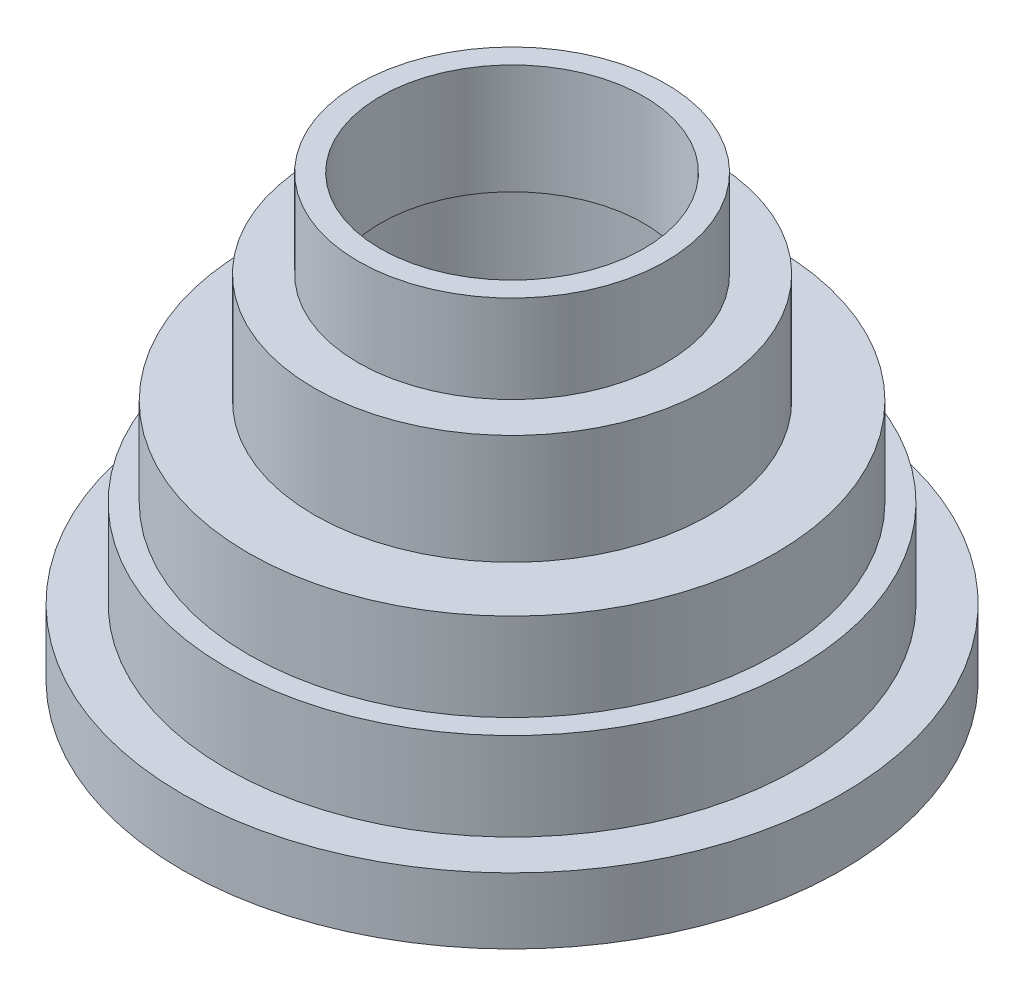
ISO-10303-21;
HEADER;
FILE_DESCRIPTION(('STEP AP214'),'2;1');
FILE_NAME('part.step','',(''),(''),'','','');
FILE_SCHEMA(('AUTOMOTIVE_DESIGN { 1 0 10303 214 1 1 1 1 }'));
ENDSEC;
DATA;
#1=APPLICATION_CONTEXT('core data for automotive mechanical design processes');
#2=APPLICATION_PROTOCOL_DEFINITION('international standard','automotive_design',2000,#1);
#3=PRODUCT_CONTEXT('',#1,'mechanical');
#4=PRODUCT('Part','Part','',(#3));
#5=PRODUCT_RELATED_PRODUCT_CATEGORY('part','',(#4));
#6=PRODUCT_DEFINITION_FORMATION('','',#4);
#7=PRODUCT_DEFINITION_CONTEXT('part definition',#1,'design');
#8=PRODUCT_DEFINITION('design','',#6,#7);
#9=PRODUCT_DEFINITION_SHAPE('','',#8);
#10=(LENGTH_UNIT() NAMED_UNIT(*) SI_UNIT(.MILLI.,.METRE.));
#11=(NAMED_UNIT(*) PLANE_ANGLE_UNIT() SI_UNIT($,.RADIAN.));
#12=(NAMED_UNIT(*) SI_UNIT($,.STERADIAN.) SOLID_ANGLE_UNIT());
#13=UNCERTAINTY_MEASURE_WITH_UNIT(LENGTH_MEASURE(1.E-05),#10,'distance_accuracy_value','');
#14=(GEOMETRIC_REPRESENTATION_CONTEXT(3) GLOBAL_UNCERTAINTY_ASSIGNED_CONTEXT((#13)) GLOBAL_UNIT_ASSIGNED_CONTEXT((#10,
#11,#12)) REPRESENTATION_CONTEXT('',''));
#15=CARTESIAN_POINT('',(0.,0.,0.));
#16=DIRECTION('',(0.,0.,1.));
#17=DIRECTION('',(1.,0.,0.));
#18=AXIS2_PLACEMENT_3D('',#15,#16,#17);
#19=CARTESIAN_POINT('',(0.,50.,0.));
#20=DIRECTION('',(0.,1.,0.));
#21=DIRECTION('',(0.,0.,1.));
#22=AXIS2_PLACEMENT_3D('',#19,#20,#21);
#23=CYLINDRICAL_SURFACE('',#22,30.);
#24=CARTESIAN_POINT('',(0.,47.7659574468085,0.));
#25=DIRECTION('',(0.,1.,0.));
#26=DIRECTION('',(0.,0.,1.));
#27=AXIS2_PLACEMENT_3D('',#24,#25,#26);
#28=CIRCLE('',#27,30.);
#29=CARTESIAN_POINT('',(0.,47.7659574468085,30.));
#30=VERTEX_POINT('',#29);
#31=EDGE_CURVE('E126',#30,#30,#28,.T.);
#32=ORIENTED_EDGE('',*,*,#31,.T.);
#33=EDGE_LOOP('',(#32));
#34=FACE_BOUND('',#33,.T.);
#35=CARTESIAN_POINT('',(0.,22.7659574468085,0.));
#36=DIRECTION('',(0.,1.,0.));
#37=DIRECTION('',(0.,0.,1.));
#38=AXIS2_PLACEMENT_3D('',#35,#36,#37);
#39=CIRCLE('',#38,30.);
#40=CARTESIAN_POINT('',(0.,22.7659574468085,30.));
#41=VERTEX_POINT('',#40);
#42=EDGE_CURVE('E10',#41,#41,#39,.T.);
#43=ORIENTED_EDGE('',*,*,#42,.F.);
#44=EDGE_LOOP('',(#43));
#45=FACE_BOUND('',#44,.T.);
#46=ADVANCED_FACE('F43',(#34,#45),#23,.F.);
#47=CARTESIAN_POINT('',(-45.,22.7659574468085,0.));
#48=DIRECTION('',(0.,-1.,0.));
#49=DIRECTION('',(0.,0.,-1.));
#50=AXIS2_PLACEMENT_3D('',#47,#48,#49);
#51=PLANE('',#50);
#52=ORIENTED_EDGE('',*,*,#42,.T.);
#53=EDGE_LOOP('',(#52));
#54=FACE_BOUND('',#53,.T.);
#55=CARTESIAN_POINT('',(0.,22.7659574468085,0.));
#56=DIRECTION('',(0.,1.,0.));
#57=DIRECTION('',(0.,0.,1.));
#58=AXIS2_PLACEMENT_3D('',#55,#56,#57);
#59=CIRCLE('',#58,40.);
#60=CARTESIAN_POINT('',(0.,22.7659574468085,40.));
#61=VERTEX_POINT('',#60);
#62=EDGE_CURVE('E50',#61,#61,#59,.T.);
#63=ORIENTED_EDGE('',*,*,#62,.F.);
#64=EDGE_LOOP('',(#63));
#65=FACE_BOUND('',#64,.T.);
#66=ADVANCED_FACE('F211',(#54,#65),#51,.T.);
#67=CARTESIAN_POINT('',(0.,50.,0.));
#68=DIRECTION('',(0.,1.,0.));
#69=DIRECTION('',(0.,0.,1.));
#70=AXIS2_PLACEMENT_3D('',#67,#68,#69);
#71=CYLINDRICAL_SURFACE('',#70,40.);
#72=ORIENTED_EDGE('',*,*,#62,.T.);
#73=EDGE_LOOP('',(#72));
#74=FACE_BOUND('',#73,.T.);
#75=CARTESIAN_POINT('',(0.,-2.2340425531915,0.));
#76=DIRECTION('',(0.,1.,0.));
#77=DIRECTION('',(0.,0.,1.));
#78=AXIS2_PLACEMENT_3D('',#75,#76,#77);
#79=CIRCLE('',#78,40.);
#80=CARTESIAN_POINT('',(0.,-2.2340425531915,40.));
#81=VERTEX_POINT('',#80);
#82=EDGE_CURVE('E55',#81,#81,#79,.T.);
#83=ORIENTED_EDGE('',*,*,#82,.F.);
#84=EDGE_LOOP('',(#83));
#85=FACE_BOUND('',#84,.T.);
#86=ADVANCED_FACE('F215',(#74,#85),#71,.F.);
#87=CARTESIAN_POINT('',(-60.,-2.2340425531915,0.));
#88=DIRECTION('',(0.,-1.,0.));
#89=DIRECTION('',(0.,0.,-1.));
#90=AXIS2_PLACEMENT_3D('',#87,#88,#89);
#91=PLANE('',#90);
#92=ORIENTED_EDGE('',*,*,#82,.T.);
#93=EDGE_LOOP('',(#92));
#94=FACE_BOUND('',#93,.T.);
#95=CARTESIAN_POINT('',(0.,-2.2340425531915,0.));
#96=DIRECTION('',(0.,1.,0.));
#97=DIRECTION('',(0.,0.,1.));
#98=AXIS2_PLACEMENT_3D('',#95,#96,#97);
#99=CIRCLE('',#98,55.);
#100=CARTESIAN_POINT('',(0.,-2.2340425531915,55.));
#101=VERTEX_POINT('',#100);
#102=EDGE_CURVE('E60',#101,#101,#99,.T.);
#103=ORIENTED_EDGE('',*,*,#102,.F.);
#104=EDGE_LOOP('',(#103));
#105=FACE_BOUND('',#104,.T.);
#106=ADVANCED_FACE('F219',(#94,#105),#91,.T.);
#107=CARTESIAN_POINT('',(0.,50.,0.));
#108=DIRECTION('',(0.,1.,0.));
#109=DIRECTION('',(0.,0.,1.));
#110=AXIS2_PLACEMENT_3D('',#107,#108,#109);
#111=CYLINDRICAL_SURFACE('',#110,55.);
#112=ORIENTED_EDGE('',*,*,#102,.T.);
#113=EDGE_LOOP('',(#112));
#114=FACE_BOUND('',#113,.T.);
#115=CARTESIAN_POINT('',(0.,-22.2340425531915,0.));
#116=DIRECTION('',(0.,1.,0.));
#117=DIRECTION('',(0.,0.,1.));
#118=AXIS2_PLACEMENT_3D('',#115,#116,#117);
#119=CIRCLE('',#118,55.);
#120=CARTESIAN_POINT('',(0.,-22.2340425531915,55.));
#121=VERTEX_POINT('',#120);
#122=EDGE_CURVE('E66',#121,#121,#119,.T.);
#123=ORIENTED_EDGE('',*,*,#122,.F.);
#124=EDGE_LOOP('',(#123));
#125=FACE_BOUND('',#124,.T.);
#126=ADVANCED_FACE('F225',(#114,#125),#111,.F.);
#127=CARTESIAN_POINT('',(-65.,-22.2340425531915,0.));
#128=DIRECTION('',(0.,-1.,0.));
#129=DIRECTION('',(0.,0.,-1.));
#130=AXIS2_PLACEMENT_3D('',#127,#128,#129);
#131=PLANE('',#130);
#132=ORIENTED_EDGE('',*,*,#122,.T.);
#133=EDGE_LOOP('',(#132));
#134=FACE_BOUND('',#133,.T.);
#135=CARTESIAN_POINT('',(0.,-22.2340425531915,0.));
#136=DIRECTION('',(0.,1.,0.));
#137=DIRECTION('',(0.,0.,1.));
#138=AXIS2_PLACEMENT_3D('',#135,#136,#137);
#139=CIRCLE('',#138,60.);
#140=CARTESIAN_POINT('',(0.,-22.2340425531915,60.));
#141=VERTEX_POINT('',#140);
#142=EDGE_CURVE('E70',#141,#141,#139,.T.);
#143=ORIENTED_EDGE('',*,*,#142,.F.);
#144=EDGE_LOOP('',(#143));
#145=FACE_BOUND('',#144,.T.);
#146=ADVANCED_FACE('F229',(#134,#145),#131,.T.);
#147=CARTESIAN_POINT('',(0.,50.,0.));
#148=DIRECTION('',(0.,1.,0.));
#149=DIRECTION('',(0.,0.,1.));
#150=AXIS2_PLACEMENT_3D('',#147,#148,#149);
#151=CYLINDRICAL_SURFACE('',#150,60.);
#152=ORIENTED_EDGE('',*,*,#142,.T.);
#153=EDGE_LOOP('',(#152));
#154=FACE_BOUND('',#153,.T.);
#155=CARTESIAN_POINT('',(0.,-42.2340425531915,0.));
#156=DIRECTION('',(0.,1.,0.));
#157=DIRECTION('',(0.,0.,1.));
#158=AXIS2_PLACEMENT_3D('',#155,#156,#157);
#159=CIRCLE('',#158,60.);
#160=CARTESIAN_POINT('',(0.,-42.2340425531915,60.));
#161=VERTEX_POINT('',#160);
#162=EDGE_CURVE('E74',#161,#161,#159,.T.);
#163=ORIENTED_EDGE('',*,*,#162,.F.);
#164=EDGE_LOOP('',(#163));
#165=FACE_BOUND('',#164,.T.);
#166=ADVANCED_FACE('F207',(#154,#165),#151,.F.);
#167=CARTESIAN_POINT('',(-75.,-42.2340425531915,0.));
#168=DIRECTION('',(0.,-1.,0.));
#169=DIRECTION('',(0.,0.,-1.));
#170=AXIS2_PLACEMENT_3D('',#167,#168,#169);
#171=PLANE('',#170);
#172=ORIENTED_EDGE('',*,*,#162,.T.);
#173=EDGE_LOOP('',(#172));
#174=FACE_BOUND('',#173,.T.);
#175=CARTESIAN_POINT('',(0.,-42.2340425531915,0.));
#176=DIRECTION('',(0.,1.,0.));
#177=DIRECTION('',(0.,0.,1.));
#178=AXIS2_PLACEMENT_3D('',#175,#176,#177);
#179=CIRCLE('',#178,70.);
#180=CARTESIAN_POINT('',(0.,-42.2340425531915,70.));
#181=VERTEX_POINT('',#180);
#182=EDGE_CURVE('E78',#181,#181,#179,.T.);
#183=ORIENTED_EDGE('',*,*,#182,.F.);
#184=EDGE_LOOP('',(#183));
#185=FACE_BOUND('',#184,.T.);
#186=ADVANCED_FACE('F201',(#174,#185),#171,.T.);
#187=CARTESIAN_POINT('',(0.,50.,0.));
#188=DIRECTION('',(0.,1.,0.));
#189=DIRECTION('',(0.,0.,1.));
#190=AXIS2_PLACEMENT_3D('',#187,#188,#189);
#191=CYLINDRICAL_SURFACE('',#190,70.);
#192=ORIENTED_EDGE('',*,*,#182,.T.);
#193=EDGE_LOOP('',(#192));
#194=FACE_BOUND('',#193,.T.);
#195=CARTESIAN_POINT('',(0.,-52.2340425531915,0.));
#196=DIRECTION('',(0.,1.,0.));
#197=DIRECTION('',(0.,0.,1.));
#198=AXIS2_PLACEMENT_3D('',#195,#196,#197);
#199=CIRCLE('',#198,70.);
#200=CARTESIAN_POINT('',(0.,-52.2340425531915,70.));
#201=VERTEX_POINT('',#200);
#202=EDGE_CURVE('E82',#201,#201,#199,.T.);
#203=ORIENTED_EDGE('',*,*,#202,.F.);
#204=EDGE_LOOP('',(#203));
#205=FACE_BOUND('',#204,.T.);
#206=ADVANCED_FACE('F196',(#194,#205),#191,.F.);
#207=CARTESIAN_POINT('',(-70.,-52.2340425531915,0.));
#208=DIRECTION('',(0.,1.,0.));
#209=DIRECTION('',(0.,0.,1.));
#210=AXIS2_PLACEMENT_3D('',#207,#208,#209);
#211=PLANE('',#210);
#212=CARTESIAN_POINT('',(0.,-52.2340425531915,0.));
#213=DIRECTION('',(0.,1.,0.));
#214=DIRECTION('',(0.,0.,1.));
#215=AXIS2_PLACEMENT_3D('',#212,#213,#214);
#216=CIRCLE('',#215,75.);
#217=CARTESIAN_POINT('',(0.,-52.2340425531915,75.));
#218=VERTEX_POINT('',#217);
#219=EDGE_CURVE('E86',#218,#218,#216,.T.);
#220=ORIENTED_EDGE('',*,*,#219,.F.);
#221=EDGE_LOOP('',(#220));
#222=FACE_BOUND('',#221,.T.);
#223=ORIENTED_EDGE('',*,*,#202,.T.);
#224=EDGE_LOOP('',(#223));
#225=FACE_BOUND('',#224,.T.);
#226=ADVANCED_FACE('F190',(#222,#225),#211,.F.);
#227=CARTESIAN_POINT('',(0.,50.,0.));
#228=DIRECTION('',(0.,1.,0.));
#229=DIRECTION('',(0.,0.,1.));
#230=AXIS2_PLACEMENT_3D('',#227,#228,#229);
#231=CYLINDRICAL_SURFACE('',#230,75.);
#232=CARTESIAN_POINT('',(0.,-37.2340425531915,0.));
#233=DIRECTION('',(0.,1.,0.));
#234=DIRECTION('',(0.,0.,1.));
#235=AXIS2_PLACEMENT_3D('',#232,#233,#234);
#236=CIRCLE('',#235,75.);
#237=CARTESIAN_POINT('',(0.,-37.2340425531915,75.));
#238=VERTEX_POINT('',#237);
#239=EDGE_CURVE('E90',#238,#238,#236,.T.);
#240=ORIENTED_EDGE('',*,*,#239,.F.);
#241=EDGE_LOOP('',(#240));
#242=FACE_BOUND('',#241,.T.);
#243=ORIENTED_EDGE('',*,*,#219,.T.);
#244=EDGE_LOOP('',(#243));
#245=FACE_BOUND('',#244,.T.);
#246=ADVANCED_FACE('F184',(#242,#245),#231,.T.);
#247=CARTESIAN_POINT('',(-75.,-37.2340425531915,0.));
#248=DIRECTION('',(0.,-1.,0.));
#249=DIRECTION('',(0.,0.,-1.));
#250=AXIS2_PLACEMENT_3D('',#247,#248,#249);
#251=PLANE('',#250);
#252=CARTESIAN_POINT('',(0.,-37.2340425531915,0.));
#253=DIRECTION('',(0.,1.,0.));
#254=DIRECTION('',(0.,0.,1.));
#255=AXIS2_PLACEMENT_3D('',#252,#253,#254);
#256=CIRCLE('',#255,65.);
#257=CARTESIAN_POINT('',(0.,-37.2340425531915,65.));
#258=VERTEX_POINT('',#257);
#259=EDGE_CURVE('E94',#258,#258,#256,.T.);
#260=ORIENTED_EDGE('',*,*,#259,.F.);
#261=EDGE_LOOP('',(#260));
#262=FACE_BOUND('',#261,.T.);
#263=ORIENTED_EDGE('',*,*,#239,.T.);
#264=EDGE_LOOP('',(#263));
#265=FACE_BOUND('',#264,.T.);
#266=ADVANCED_FACE('F178',(#262,#265),#251,.F.);
#267=CARTESIAN_POINT('',(0.,50.,0.));
#268=DIRECTION('',(0.,1.,0.));
#269=DIRECTION('',(0.,0.,1.));
#270=AXIS2_PLACEMENT_3D('',#267,#268,#269);
#271=CYLINDRICAL_SURFACE('',#270,65.);
#272=CARTESIAN_POINT('',(0.,-17.2340425531915,0.));
#273=DIRECTION('',(0.,1.,0.));
#274=DIRECTION('',(0.,0.,1.));
#275=AXIS2_PLACEMENT_3D('',#272,#273,#274);
#276=CIRCLE('',#275,65.);
#277=CARTESIAN_POINT('',(0.,-17.2340425531915,65.));
#278=VERTEX_POINT('',#277);
#279=EDGE_CURVE('E98',#278,#278,#276,.T.);
#280=ORIENTED_EDGE('',*,*,#279,.F.);
#281=EDGE_LOOP('',(#280));
#282=FACE_BOUND('',#281,.T.);
#283=ORIENTED_EDGE('',*,*,#259,.T.);
#284=EDGE_LOOP('',(#283));
#285=FACE_BOUND('',#284,.T.);
#286=ADVANCED_FACE('F172',(#282,#285),#271,.T.);
#287=CARTESIAN_POINT('',(-65.,-17.2340425531915,0.));
#288=DIRECTION('',(0.,-1.,0.));
#289=DIRECTION('',(0.,0.,-1.));
#290=AXIS2_PLACEMENT_3D('',#287,#288,#289);
#291=PLANE('',#290);
#292=CARTESIAN_POINT('',(0.,-17.2340425531915,0.));
#293=DIRECTION('',(0.,1.,0.));
#294=DIRECTION('',(0.,0.,1.));
#295=AXIS2_PLACEMENT_3D('',#292,#293,#294);
#296=CIRCLE('',#295,60.);
#297=CARTESIAN_POINT('',(0.,-17.2340425531915,60.));
#298=VERTEX_POINT('',#297);
#299=EDGE_CURVE('E102',#298,#298,#296,.T.);
#300=ORIENTED_EDGE('',*,*,#299,.F.);
#301=EDGE_LOOP('',(#300));
#302=FACE_BOUND('',#301,.T.);
#303=ORIENTED_EDGE('',*,*,#279,.T.);
#304=EDGE_LOOP('',(#303));
#305=FACE_BOUND('',#304,.T.);
#306=ADVANCED_FACE('F166',(#302,#305),#291,.F.);
#307=CARTESIAN_POINT('',(0.,50.,0.));
#308=DIRECTION('',(0.,1.,0.));
#309=DIRECTION('',(0.,0.,1.));
#310=AXIS2_PLACEMENT_3D('',#307,#308,#309);
#311=CYLINDRICAL_SURFACE('',#310,60.);
#312=CARTESIAN_POINT('',(0.,2.7659574468085,0.));
#313=DIRECTION('',(0.,1.,0.));
#314=DIRECTION('',(0.,0.,1.));
#315=AXIS2_PLACEMENT_3D('',#312,#313,#314);
#316=CIRCLE('',#315,60.);
#317=CARTESIAN_POINT('',(0.,2.7659574468085,60.));
#318=VERTEX_POINT('',#317);
#319=EDGE_CURVE('E106',#318,#318,#316,.T.);
#320=ORIENTED_EDGE('',*,*,#319,.F.);
#321=EDGE_LOOP('',(#320));
#322=FACE_BOUND('',#321,.T.);
#323=ORIENTED_EDGE('',*,*,#299,.T.);
#324=EDGE_LOOP('',(#323));
#325=FACE_BOUND('',#324,.T.);
#326=ADVANCED_FACE('F160',(#322,#325),#311,.T.);
#327=CARTESIAN_POINT('',(-60.,2.7659574468085,0.));
#328=DIRECTION('',(0.,-1.,0.));
#329=DIRECTION('',(0.,0.,-1.));
#330=AXIS2_PLACEMENT_3D('',#327,#328,#329);
#331=PLANE('',#330);
#332=CARTESIAN_POINT('',(0.,2.7659574468085,0.));
#333=DIRECTION('',(0.,1.,0.));
#334=DIRECTION('',(0.,0.,1.));
#335=AXIS2_PLACEMENT_3D('',#332,#333,#334);
#336=CIRCLE('',#335,45.);
#337=CARTESIAN_POINT('',(0.,2.7659574468085,45.));
#338=VERTEX_POINT('',#337);
#339=EDGE_CURVE('E110',#338,#338,#336,.T.);
#340=ORIENTED_EDGE('',*,*,#339,.F.);
#341=EDGE_LOOP('',(#340));
#342=FACE_BOUND('',#341,.T.);
#343=ORIENTED_EDGE('',*,*,#319,.T.);
#344=EDGE_LOOP('',(#343));
#345=FACE_BOUND('',#344,.T.);
#346=ADVANCED_FACE('F154',(#342,#345),#331,.F.);
#347=CARTESIAN_POINT('',(0.,50.,0.));
#348=DIRECTION('',(0.,1.,0.));
#349=DIRECTION('',(0.,0.,1.));
#350=AXIS2_PLACEMENT_3D('',#347,#348,#349);
#351=CYLINDRICAL_SURFACE('',#350,45.);
#352=CARTESIAN_POINT('',(0.,27.7659574468085,0.));
#353=DIRECTION('',(0.,1.,0.));
#354=DIRECTION('',(0.,0.,1.));
#355=AXIS2_PLACEMENT_3D('',#352,#353,#354);
#356=CIRCLE('',#355,45.);
#357=CARTESIAN_POINT('',(0.,27.7659574468085,45.));
#358=VERTEX_POINT('',#357);
#359=EDGE_CURVE('E114',#358,#358,#356,.T.);
#360=ORIENTED_EDGE('',*,*,#359,.F.);
#361=EDGE_LOOP('',(#360));
#362=FACE_BOUND('',#361,.T.);
#363=ORIENTED_EDGE('',*,*,#339,.T.);
#364=EDGE_LOOP('',(#363));
#365=FACE_BOUND('',#364,.T.);
#366=ADVANCED_FACE('F148',(#362,#365),#351,.T.);
#367=CARTESIAN_POINT('',(-45.,27.7659574468085,0.));
#368=DIRECTION('',(0.,-1.,0.));
#369=DIRECTION('',(0.,0.,-1.));
#370=AXIS2_PLACEMENT_3D('',#367,#368,#369);
#371=PLANE('',#370);
#372=CARTESIAN_POINT('',(0.,27.7659574468085,0.));
#373=DIRECTION('',(0.,1.,0.));
#374=DIRECTION('',(0.,0.,1.));
#375=AXIS2_PLACEMENT_3D('',#372,#373,#374);
#376=CIRCLE('',#375,35.);
#377=CARTESIAN_POINT('',(0.,27.7659574468085,35.));
#378=VERTEX_POINT('',#377);
#379=EDGE_CURVE('E118',#378,#378,#376,.T.);
#380=ORIENTED_EDGE('',*,*,#379,.F.);
#381=EDGE_LOOP('',(#380));
#382=FACE_BOUND('',#381,.T.);
#383=ORIENTED_EDGE('',*,*,#359,.T.);
#384=EDGE_LOOP('',(#383));
#385=FACE_BOUND('',#384,.T.);
#386=ADVANCED_FACE('F142',(#382,#385),#371,.F.);
#387=CARTESIAN_POINT('',(0.,50.,0.));
#388=DIRECTION('',(0.,1.,0.));
#389=DIRECTION('',(0.,0.,1.));
#390=AXIS2_PLACEMENT_3D('',#387,#388,#389);
#391=CYLINDRICAL_SURFACE('',#390,35.);
#392=CARTESIAN_POINT('',(0.,47.7659574468085,0.));
#393=DIRECTION('',(0.,1.,0.));
#394=DIRECTION('',(0.,0.,1.));
#395=AXIS2_PLACEMENT_3D('',#392,#393,#394);
#396=CIRCLE('',#395,35.);
#397=CARTESIAN_POINT('',(0.,47.7659574468085,35.));
#398=VERTEX_POINT('',#397);
#399=EDGE_CURVE('E122',#398,#398,#396,.T.);
#400=ORIENTED_EDGE('',*,*,#399,.F.);
#401=EDGE_LOOP('',(#400));
#402=FACE_BOUND('',#401,.T.);
#403=ORIENTED_EDGE('',*,*,#379,.T.);
#404=EDGE_LOOP('',(#403));
#405=FACE_BOUND('',#404,.T.);
#406=ADVANCED_FACE('F136',(#402,#405),#391,.T.);
#407=CARTESIAN_POINT('',(-35.,47.7659574468085,0.));
#408=DIRECTION('',(0.,-1.,0.));
#409=DIRECTION('',(0.,0.,-1.));
#410=AXIS2_PLACEMENT_3D('',#407,#408,#409);
#411=PLANE('',#410);
#412=ORIENTED_EDGE('',*,*,#31,.F.);
#413=EDGE_LOOP('',(#412));
#414=FACE_BOUND('',#413,.T.);
#415=ORIENTED_EDGE('',*,*,#399,.T.);
#416=EDGE_LOOP('',(#415));
#417=FACE_BOUND('',#416,.T.);
#418=ADVANCED_FACE('F133',(#414,#417),#411,.F.);
#419=CLOSED_SHELL('',(#46,#66,#86,#106,#126,#146,#166,#186,#206,#226,#246,#266,#286,#306,#326,
#346,#366,#386,#406,#418));
#420=MANIFOLD_SOLID_BREP('B2',#419);
#421=ADVANCED_BREP_SHAPE_REPRESENTATION('',(#18,#420),#14);
#422=SHAPE_DEFINITION_REPRESENTATION(#9,#421);
ENDSEC;
END-ISO-10303-21;
